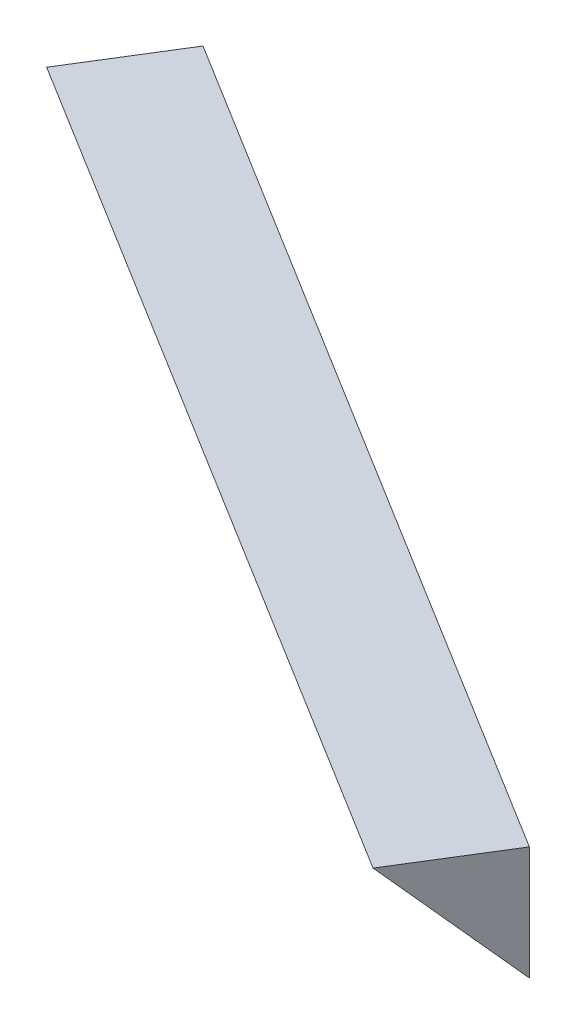
ISO-10303-21;
HEADER;
FILE_DESCRIPTION(('STEP AP214'),'2;1');
FILE_NAME('part.step','',(''),(''),'','','');
FILE_SCHEMA(('AUTOMOTIVE_DESIGN { 1 0 10303 214 1 1 1 1 }'));
ENDSEC;
DATA;
#1=APPLICATION_CONTEXT('core data for automotive mechanical design processes');
#2=APPLICATION_PROTOCOL_DEFINITION('international standard','automotive_design',2000,#1);
#3=PRODUCT_CONTEXT('',#1,'mechanical');
#4=PRODUCT('Part','Part','',(#3));
#5=PRODUCT_RELATED_PRODUCT_CATEGORY('part','',(#4));
#6=PRODUCT_DEFINITION_FORMATION('','',#4);
#7=PRODUCT_DEFINITION_CONTEXT('part definition',#1,'design');
#8=PRODUCT_DEFINITION('design','',#6,#7);
#9=PRODUCT_DEFINITION_SHAPE('','',#8);
#10=(LENGTH_UNIT() NAMED_UNIT(*) SI_UNIT(.MILLI.,.METRE.));
#11=(NAMED_UNIT(*) PLANE_ANGLE_UNIT() SI_UNIT($,.RADIAN.));
#12=(NAMED_UNIT(*) SI_UNIT($,.STERADIAN.) SOLID_ANGLE_UNIT());
#13=UNCERTAINTY_MEASURE_WITH_UNIT(LENGTH_MEASURE(1.E-05),#10,'distance_accuracy_value','');
#14=(GEOMETRIC_REPRESENTATION_CONTEXT(3) GLOBAL_UNCERTAINTY_ASSIGNED_CONTEXT((#13)) GLOBAL_UNIT_ASSIGNED_CONTEXT((#10,
#11,#12)) REPRESENTATION_CONTEXT('',''));
#15=CARTESIAN_POINT('',(0.,0.,0.));
#16=DIRECTION('',(0.,0.,1.));
#17=DIRECTION('',(1.,0.,0.));
#18=AXIS2_PLACEMENT_3D('',#15,#16,#17);
#19=CARTESIAN_POINT('',(78.3836755118485,-82.5966418379384,265.973990321899));
#20=DIRECTION('',(0.850265146687862,0.,0.526354614616295));
#21=DIRECTION('',(0.526354614616295,0.,-0.850265146687862));
#22=AXIS2_PLACEMENT_3D('',#19,#20,#21);
#23=PLANE('',#22);
#24=DIRECTION('',(-0.372188917303987,0.707106781186524,0.601228251029606));
#25=VECTOR('',#24,1.);
#26=CARTESIAN_POINT('',(79.0278393000116,-81.3728209189692,264.933418048712));
#27=LINE('',#26,#25);
#28=CARTESIAN_POINT('',(79.6714767335606,-82.5956418379384,263.893696040671));
#29=VERTEX_POINT('',#28);
#30=CARTESIAN_POINT('',(78.3842018664632,-80.1499999999999,265.973140056752));
#31=VERTEX_POINT('',#30);
#32=EDGE_CURVE('E56',#29,#31,#27,.T.);
#33=ORIENTED_EDGE('',*,*,#32,.F.);
#34=DIRECTION('',(0.,-1.,0.));
#35=VECTOR('',#34,1.);
#36=CARTESIAN_POINT('',(79.6714767335604,-81.3728209189692,263.893696040671));
#37=LINE('',#36,#35);
#38=CARTESIAN_POINT('',(79.6714767335608,-80.1499999999999,263.893696040671));
#39=VERTEX_POINT('',#38);
#40=EDGE_CURVE('E52',#39,#29,#37,.T.);
#41=ORIENTED_EDGE('',*,*,#40,.F.);
#42=DIRECTION('',(0.526354614616301,0.,-0.850265146687858));
#43=VECTOR('',#42,1.);
#44=CARTESIAN_POINT('',(79.027839300012,-80.1499999999999,264.933418048711));
#45=LINE('',#44,#43);
#46=EDGE_CURVE('E20',#31,#39,#45,.T.);
#47=ORIENTED_EDGE('',*,*,#46,.F.);
#48=EDGE_LOOP('',(#33,#41,#47));
#49=FACE_BOUND('',#48,.T.);
#50=ADVANCED_FACE('F16',(#49),#23,.T.);
#51=CARTESIAN_POINT('',(78.3845257769951,-80.1499999999999,265.974516676513));
#52=DIRECTION('',(0.,1.,0.));
#53=DIRECTION('',(0.526354614616301,0.,-0.850265146687858));
#54=AXIS2_PLACEMENT_3D('',#51,#52,#53);
#55=PLANE('',#54);
#56=DIRECTION('',(0.526354614616318,0.,-0.850265146687848));
#57=VECTOR('',#56,1.);
#58=CARTESIAN_POINT('',(60.5786347400754,-80.1499999999999,253.51248189256));
#59=LINE('',#58,#57);
#60=CARTESIAN_POINT('',(59.9349973065265,-80.1499999999999,254.552203900601));
#61=VERTEX_POINT('',#60);
#62=CARTESIAN_POINT('',(61.2222721736241,-80.1499999999999,252.47275988452));
#63=VERTEX_POINT('',#62);
#64=EDGE_CURVE('E47',#61,#63,#59,.T.);
#65=ORIENTED_EDGE('',*,*,#64,.F.);
#66=DIRECTION('',(-0.850265146687849,0.,-0.526354614616316));
#67=VECTOR('',#66,1.);
#68=CARTESIAN_POINT('',(69.1595995864949,-80.1500000000001,260.262671978676));
#69=LINE('',#68,#67);
#70=EDGE_CURVE('E65',#31,#61,#69,.T.);
#71=ORIENTED_EDGE('',*,*,#70,.F.);
#72=ORIENTED_EDGE('',*,*,#46,.T.);
#73=DIRECTION('',(0.850265146687848,0.,0.526354614616318));
#74=VECTOR('',#73,1.);
#75=CARTESIAN_POINT('',(70.4468744535924,-80.1499999999999,258.183227962596));
#76=LINE('',#75,#74);
#77=EDGE_CURVE('E63',#63,#39,#76,.T.);
#78=ORIENTED_EDGE('',*,*,#77,.F.);
#79=EDGE_LOOP('',(#65,#71,#72,#78));
#80=FACE_BOUND('',#79,.T.);
#81=ADVANCED_FACE('F62',(#80),#55,.T.);
#82=CARTESIAN_POINT('',(61.2227985282388,-82.5966418379383,252.471909619373));
#83=DIRECTION('',(-0.850265146687848,0.,-0.526354614616318));
#84=DIRECTION('',(-0.526354614616318,0.,0.850265146687848));
#85=AXIS2_PLACEMENT_3D('',#82,#83,#84);
#86=PLANE('',#85);
#87=DIRECTION('',(0.,1.,0.));
#88=VECTOR('',#87,1.);
#89=CARTESIAN_POINT('',(61.2222721736244,-81.3728209189691,252.47275988452));
#90=LINE('',#89,#88);
#91=CARTESIAN_POINT('',(61.2222721736242,-82.5956418379383,252.47275988452));
#92=VERTEX_POINT('',#91);
#93=EDGE_CURVE('E36',#92,#63,#90,.T.);
#94=ORIENTED_EDGE('',*,*,#93,.F.);
#95=DIRECTION('',(0.372188917304008,-0.707106781186514,-0.601228251029605));
#96=VECTOR('',#95,1.);
#97=CARTESIAN_POINT('',(60.5786347400756,-81.3728209189691,253.51248189256));
#98=LINE('',#97,#96);
#99=EDGE_CURVE('E27',#61,#92,#98,.T.);
#100=ORIENTED_EDGE('',*,*,#99,.F.);
#101=ORIENTED_EDGE('',*,*,#64,.T.);
#102=EDGE_LOOP('',(#94,#100,#101));
#103=FACE_BOUND('',#102,.T.);
#104=ADVANCED_FACE('F89',(#103),#86,.T.);
#105=CARTESIAN_POINT('',(79.6723269987073,-80.1489999999999,263.894222395286));
#106=DIRECTION('',(0.526354614616318,0.,-0.850265146687848));
#107=DIRECTION('',(0.,-1.,0.));
#108=AXIS2_PLACEMENT_3D('',#105,#106,#107);
#109=PLANE('',#108);
#110=ORIENTED_EDGE('',*,*,#93,.T.);
#111=ORIENTED_EDGE('',*,*,#77,.T.);
#112=ORIENTED_EDGE('',*,*,#40,.T.);
#113=DIRECTION('',(0.850265146687849,0.,0.526354614616317));
#114=VECTOR('',#113,1.);
#115=CARTESIAN_POINT('',(70.4468744535924,-82.5956418379382,258.183227962596));
#116=LINE('',#115,#114);
#117=EDGE_CURVE('E11',#92,#29,#116,.T.);
#118=ORIENTED_EDGE('',*,*,#117,.F.);
#119=EDGE_LOOP('',(#110,#111,#112,#118));
#120=FACE_BOUND('',#119,.T.);
#121=ADVANCED_FACE('F67',(#120),#109,.T.);
#122=CARTESIAN_POINT('',(79.6726991876247,-82.5963489447196,263.893621167035));
#123=DIRECTION('',(-0.372188917304018,-0.707106781186571,0.601228251029531));
#124=DIRECTION('',(-0.372188917303987,0.707106781186524,0.601228251029606));
#125=AXIS2_PLACEMENT_3D('',#122,#123,#124);
#126=PLANE('',#125);
#127=ORIENTED_EDGE('',*,*,#99,.T.);
#128=ORIENTED_EDGE('',*,*,#117,.T.);
#129=ORIENTED_EDGE('',*,*,#32,.T.);
#130=ORIENTED_EDGE('',*,*,#70,.T.);
#131=EDGE_LOOP('',(#127,#128,#129,#130));
#132=FACE_BOUND('',#131,.T.);
#133=ADVANCED_FACE('F18',(#132),#126,.T.);
#134=CLOSED_SHELL('',(#50,#81,#104,#121,#133));
#135=MANIFOLD_SOLID_BREP('B1',#134);
#136=ADVANCED_BREP_SHAPE_REPRESENTATION('',(#18,#135),#14);
#137=SHAPE_DEFINITION_REPRESENTATION(#9,#136);
ENDSEC;
END-ISO-10303-21;
